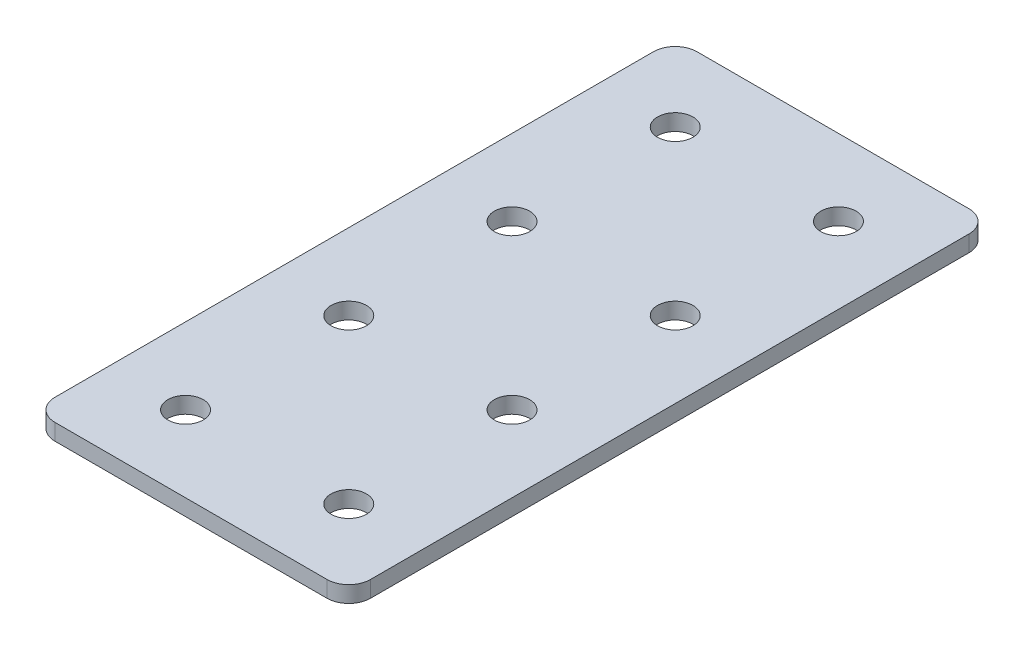
ISO-10303-21;
HEADER;
FILE_DESCRIPTION(('STEP AP214'),'2;1');
FILE_NAME('part.step','',(''),(''),'','','');
FILE_SCHEMA(('AUTOMOTIVE_DESIGN { 1 0 10303 214 1 1 1 1 }'));
ENDSEC;
DATA;
#1=APPLICATION_CONTEXT('core data for automotive mechanical design processes');
#2=APPLICATION_PROTOCOL_DEFINITION('international standard','automotive_design',2000,#1);
#3=PRODUCT_CONTEXT('',#1,'mechanical');
#4=PRODUCT('Part','Part','',(#3));
#5=PRODUCT_RELATED_PRODUCT_CATEGORY('part','',(#4));
#6=PRODUCT_DEFINITION_FORMATION('','',#4);
#7=PRODUCT_DEFINITION_CONTEXT('part definition',#1,'design');
#8=PRODUCT_DEFINITION('design','',#6,#7);
#9=PRODUCT_DEFINITION_SHAPE('','',#8);
#10=(LENGTH_UNIT() NAMED_UNIT(*) SI_UNIT(.MILLI.,.METRE.));
#11=(NAMED_UNIT(*) PLANE_ANGLE_UNIT() SI_UNIT($,.RADIAN.));
#12=(NAMED_UNIT(*) SI_UNIT($,.STERADIAN.) SOLID_ANGLE_UNIT());
#13=UNCERTAINTY_MEASURE_WITH_UNIT(LENGTH_MEASURE(1.E-05),#10,'distance_accuracy_value','');
#14=(GEOMETRIC_REPRESENTATION_CONTEXT(3) GLOBAL_UNCERTAINTY_ASSIGNED_CONTEXT((#13)) GLOBAL_UNIT_ASSIGNED_CONTEXT((#10,
#11,#12)) REPRESENTATION_CONTEXT('',''));
#15=CARTESIAN_POINT('',(0.,0.,0.));
#16=DIRECTION('',(0.,0.,1.));
#17=DIRECTION('',(1.,0.,0.));
#18=AXIS2_PLACEMENT_3D('',#15,#16,#17);
#19=CARTESIAN_POINT('',(-0.94100235452288,1.30807034319605,-23.6167335219397));
#20=DIRECTION('',(0.,-1.,0.));
#21=DIRECTION('',(0.,0.,-1.));
#22=AXIS2_PLACEMENT_3D('',#19,#20,#21);
#23=PLANE('',#22);
#24=CARTESIAN_POINT('',(6.55899764547713,1.30807034319605,21.3832664780603));
#25=DIRECTION('',(0.,1.,0.));
#26=DIRECTION('',(0.,0.,1.));
#27=AXIS2_PLACEMENT_3D('',#24,#25,#26);
#28=CIRCLE('',#27,1.625);
#29=CARTESIAN_POINT('',(6.55899764547713,1.30807034319605,23.0082664780603));
#30=VERTEX_POINT('',#29);
#31=EDGE_CURVE('E189',#30,#30,#28,.T.);
#32=ORIENTED_EDGE('',*,*,#31,.T.);
#33=EDGE_LOOP('',(#32));
#34=FACE_BOUND('',#33,.T.);
#35=CARTESIAN_POINT('',(-8.4410023545229,1.30807034319605,21.3832664780603));
#36=DIRECTION('',(0.,1.,0.));
#37=DIRECTION('',(0.,0.,1.));
#38=AXIS2_PLACEMENT_3D('',#35,#36,#37);
#39=CIRCLE('',#38,1.625);
#40=CARTESIAN_POINT('',(-8.4410023545229,1.30807034319605,23.0082664780603));
#41=VERTEX_POINT('',#40);
#42=EDGE_CURVE('E183',#41,#41,#39,.T.);
#43=ORIENTED_EDGE('',*,*,#42,.T.);
#44=EDGE_LOOP('',(#43));
#45=FACE_BOUND('',#44,.T.);
#46=CARTESIAN_POINT('',(6.55899764547713,1.30807034319605,6.38326647806029));
#47=DIRECTION('',(0.,1.,0.));
#48=DIRECTION('',(0.,0.,1.));
#49=AXIS2_PLACEMENT_3D('',#46,#47,#48);
#50=CIRCLE('',#49,1.625);
#51=CARTESIAN_POINT('',(6.55899764547713,1.30807034319605,8.0082664780603));
#52=VERTEX_POINT('',#51);
#53=EDGE_CURVE('E177',#52,#52,#50,.T.);
#54=ORIENTED_EDGE('',*,*,#53,.T.);
#55=EDGE_LOOP('',(#54));
#56=FACE_BOUND('',#55,.T.);
#57=CARTESIAN_POINT('',(-8.44100235452291,1.30807034319605,6.38326647806029));
#58=DIRECTION('',(0.,1.,0.));
#59=DIRECTION('',(0.,0.,1.));
#60=AXIS2_PLACEMENT_3D('',#57,#58,#59);
#61=CIRCLE('',#60,1.625);
#62=CARTESIAN_POINT('',(-8.44100235452291,1.30807034319605,8.00826647806029));
#63=VERTEX_POINT('',#62);
#64=EDGE_CURVE('E171',#63,#63,#61,.T.);
#65=ORIENTED_EDGE('',*,*,#64,.T.);
#66=EDGE_LOOP('',(#65));
#67=FACE_BOUND('',#66,.T.);
#68=CARTESIAN_POINT('',(6.55899764547713,1.30807034319605,-8.61673352193971));
#69=DIRECTION('',(0.,1.,0.));
#70=DIRECTION('',(0.,0.,1.));
#71=AXIS2_PLACEMENT_3D('',#68,#69,#70);
#72=CIRCLE('',#71,1.625);
#73=CARTESIAN_POINT('',(6.55899764547713,1.30807034319605,-6.99173352193971));
#74=VERTEX_POINT('',#73);
#75=EDGE_CURVE('E165',#74,#74,#72,.T.);
#76=ORIENTED_EDGE('',*,*,#75,.T.);
#77=EDGE_LOOP('',(#76));
#78=FACE_BOUND('',#77,.T.);
#79=CARTESIAN_POINT('',(-8.44100235452291,1.30807034319605,-8.61673352193971));
#80=DIRECTION('',(0.,1.,0.));
#81=DIRECTION('',(0.,0.,1.));
#82=AXIS2_PLACEMENT_3D('',#79,#80,#81);
#83=CIRCLE('',#82,1.625);
#84=CARTESIAN_POINT('',(-8.44100235452291,1.30807034319605,-6.99173352193971));
#85=VERTEX_POINT('',#84);
#86=EDGE_CURVE('E159',#85,#85,#83,.T.);
#87=ORIENTED_EDGE('',*,*,#86,.T.);
#88=EDGE_LOOP('',(#87));
#89=FACE_BOUND('',#88,.T.);
#90=CARTESIAN_POINT('',(6.55899764547713,1.30807034319605,-23.6167335219397));
#91=DIRECTION('',(0.,1.,0.));
#92=DIRECTION('',(0.,0.,1.));
#93=AXIS2_PLACEMENT_3D('',#90,#91,#92);
#94=CIRCLE('',#93,1.625);
#95=CARTESIAN_POINT('',(6.55899764547713,1.30807034319605,-21.9917335219397));
#96=VERTEX_POINT('',#95);
#97=EDGE_CURVE('E154',#96,#96,#94,.T.);
#98=ORIENTED_EDGE('',*,*,#97,.T.);
#99=EDGE_LOOP('',(#98));
#100=FACE_BOUND('',#99,.T.);
#101=CARTESIAN_POINT('',(-8.44100235452291,1.30807034319605,-23.6167335219397));
#102=DIRECTION('',(0.,1.,0.));
#103=DIRECTION('',(0.,0.,1.));
#104=AXIS2_PLACEMENT_3D('',#101,#102,#103);
#105=CIRCLE('',#104,1.625);
#106=CARTESIAN_POINT('',(-8.44100235452291,1.30807034319605,-21.9917335219397));
#107=VERTEX_POINT('',#106);
#108=EDGE_CURVE('E147',#107,#107,#105,.T.);
#109=ORIENTED_EDGE('',*,*,#108,.T.);
#110=EDGE_LOOP('',(#109));
#111=FACE_BOUND('',#110,.T.);
#112=DIRECTION('',(0.,0.,-1.));
#113=VECTOR('',#112,1.);
#114=CARTESIAN_POINT('',(13.5589976454772,1.30807034319605,28.3832664780603));
#115=LINE('',#114,#113);
#116=CARTESIAN_POINT('',(13.5589976454772,1.30807034319605,26.3832664780602));
#117=VERTEX_POINT('',#116);
#118=CARTESIAN_POINT('',(13.5589976454772,1.30807034319605,-28.6167335219397));
#119=VERTEX_POINT('',#118);
#120=EDGE_CURVE('E106',#117,#119,#115,.T.);
#121=ORIENTED_EDGE('',*,*,#120,.F.);
#122=CARTESIAN_POINT('',(11.5589976454772,1.30807034319605,26.3832664780602));
#123=DIRECTION('',(0.,-1.,0.));
#124=DIRECTION('',(0.,0.,-1.));
#125=AXIS2_PLACEMENT_3D('',#122,#123,#124);
#126=CIRCLE('',#125,2.);
#127=CARTESIAN_POINT('',(11.5589976454772,1.30807034319605,28.3832664780603));
#128=VERTEX_POINT('',#127);
#129=EDGE_CURVE('E128',#117,#128,#126,.T.);
#130=ORIENTED_EDGE('',*,*,#129,.T.);
#131=DIRECTION('',(1.,0.,0.));
#132=VECTOR('',#131,1.);
#133=CARTESIAN_POINT('',(-15.441002354523,1.30807034319605,28.3832664780603));
#134=LINE('',#133,#132);
#135=CARTESIAN_POINT('',(-13.441002354523,1.30807034319605,28.3832664780603));
#136=VERTEX_POINT('',#135);
#137=EDGE_CURVE('E110',#136,#128,#134,.T.);
#138=ORIENTED_EDGE('',*,*,#137,.F.);
#139=CARTESIAN_POINT('',(-13.441002354523,1.30807034319605,26.3832664780602));
#140=DIRECTION('',(0.,-1.,0.));
#141=DIRECTION('',(0.,0.,-1.));
#142=AXIS2_PLACEMENT_3D('',#139,#140,#141);
#143=CIRCLE('',#142,2.);
#144=CARTESIAN_POINT('',(-15.441002354523,1.30807034319605,26.3832664780602));
#145=VERTEX_POINT('',#144);
#146=EDGE_CURVE('E105',#136,#145,#143,.T.);
#147=ORIENTED_EDGE('',*,*,#146,.T.);
#148=DIRECTION('',(0.,0.,1.));
#149=VECTOR('',#148,1.);
#150=CARTESIAN_POINT('',(-15.441002354523,1.30807034319605,-30.6167335219397));
#151=LINE('',#150,#149);
#152=CARTESIAN_POINT('',(-15.441002354523,1.30807034319605,-28.6167335219397));
#153=VERTEX_POINT('',#152);
#154=EDGE_CURVE('E137',#153,#145,#151,.T.);
#155=ORIENTED_EDGE('',*,*,#154,.F.);
#156=CARTESIAN_POINT('',(-13.441002354523,1.30807034319605,-28.6167335219397));
#157=DIRECTION('',(0.,-1.,0.));
#158=DIRECTION('',(0.,0.,-1.));
#159=AXIS2_PLACEMENT_3D('',#156,#157,#158);
#160=CIRCLE('',#159,2.);
#161=CARTESIAN_POINT('',(-13.441002354523,1.30807034319605,-30.6167335219397));
#162=VERTEX_POINT('',#161);
#163=EDGE_CURVE('E31',#153,#162,#160,.T.);
#164=ORIENTED_EDGE('',*,*,#163,.T.);
#165=DIRECTION('',(-1.,0.,0.));
#166=VECTOR('',#165,1.);
#167=CARTESIAN_POINT('',(13.5589976454772,1.30807034319605,-30.6167335219398));
#168=LINE('',#167,#166);
#169=CARTESIAN_POINT('',(11.5589976454772,1.30807034319605,-30.6167335219398));
#170=VERTEX_POINT('',#169);
#171=EDGE_CURVE('E138',#170,#162,#168,.T.);
#172=ORIENTED_EDGE('',*,*,#171,.F.);
#173=CARTESIAN_POINT('',(11.5589976454772,1.30807034319605,-28.6167335219398));
#174=DIRECTION('',(0.,-1.,0.));
#175=DIRECTION('',(0.,0.,-1.));
#176=AXIS2_PLACEMENT_3D('',#173,#174,#175);
#177=CIRCLE('',#176,2.);
#178=EDGE_CURVE('E126',#170,#119,#177,.T.);
#179=ORIENTED_EDGE('',*,*,#178,.T.);
#180=EDGE_LOOP('',(#121,#130,#138,#147,#155,#164,#172,#179));
#181=FACE_BOUND('',#180,.T.);
#182=ADVANCED_FACE('F16',(#34,#45,#56,#67,#78,#89,#100,#111,#181),#23,.T.);
#183=CARTESIAN_POINT('',(13.5589976454772,1.30807034319605,-30.6167335219398));
#184=DIRECTION('',(0.,0.,-1.));
#185=DIRECTION('',(-1.,0.,0.));
#186=AXIS2_PLACEMENT_3D('',#183,#184,#185);
#187=PLANE('',#186);
#188=DIRECTION('',(-1.,0.,0.));
#189=VECTOR('',#188,1.);
#190=CARTESIAN_POINT('',(13.5589976454772,2.80807034319605,-30.6167335219398));
#191=LINE('',#190,#189);
#192=CARTESIAN_POINT('',(11.5589976454772,2.80807034319605,-30.6167335219398));
#193=VERTEX_POINT('',#192);
#194=CARTESIAN_POINT('',(-13.441002354523,2.80807034319605,-30.6167335219397));
#195=VERTEX_POINT('',#194);
#196=EDGE_CURVE('E144',#193,#195,#191,.T.);
#197=ORIENTED_EDGE('',*,*,#196,.F.);
#198=DIRECTION('',(0.,1.,0.));
#199=VECTOR('',#198,1.);
#200=CARTESIAN_POINT('',(11.5589976454772,1.30807034319605,-30.6167335219398));
#201=LINE('',#200,#199);
#202=EDGE_CURVE('E38',#193,#170,#201,.F.);
#203=ORIENTED_EDGE('',*,*,#202,.T.);
#204=ORIENTED_EDGE('',*,*,#171,.T.);
#205=DIRECTION('',(0.,1.,0.));
#206=VECTOR('',#205,1.);
#207=CARTESIAN_POINT('',(-13.441002354523,1.30807034319605,-30.6167335219397));
#208=LINE('',#207,#206);
#209=EDGE_CURVE('E130',#162,#195,#208,.T.);
#210=ORIENTED_EDGE('',*,*,#209,.T.);
#211=EDGE_LOOP('',(#197,#203,#204,#210));
#212=FACE_BOUND('',#211,.T.);
#213=ADVANCED_FACE('F239',(#212),#187,.T.);
#214=CARTESIAN_POINT('',(13.5589976454772,1.30807034319605,28.3832664780603));
#215=DIRECTION('',(1.,0.,0.));
#216=DIRECTION('',(0.,0.,-1.));
#217=AXIS2_PLACEMENT_3D('',#214,#215,#216);
#218=PLANE('',#217);
#219=DIRECTION('',(0.,0.,-1.));
#220=VECTOR('',#219,1.);
#221=CARTESIAN_POINT('',(13.5589976454772,2.80807034319605,28.3832664780603));
#222=LINE('',#221,#220);
#223=CARTESIAN_POINT('',(13.5589976454772,2.80807034319605,26.3832664780602));
#224=VERTEX_POINT('',#223);
#225=CARTESIAN_POINT('',(13.5589976454772,2.80807034319605,-28.6167335219397));
#226=VERTEX_POINT('',#225);
#227=EDGE_CURVE('E102',#224,#226,#222,.T.);
#228=ORIENTED_EDGE('',*,*,#227,.F.);
#229=DIRECTION('',(0.,1.,0.));
#230=VECTOR('',#229,1.);
#231=CARTESIAN_POINT('',(13.5589976454772,1.30807034319605,26.3832664780602));
#232=LINE('',#231,#230);
#233=EDGE_CURVE('E122',#224,#117,#232,.F.);
#234=ORIENTED_EDGE('',*,*,#233,.T.);
#235=ORIENTED_EDGE('',*,*,#120,.T.);
#236=DIRECTION('',(0.,1.,0.));
#237=VECTOR('',#236,1.);
#238=CARTESIAN_POINT('',(13.5589976454772,1.30807034319605,-28.6167335219398));
#239=LINE('',#238,#237);
#240=EDGE_CURVE('E119',#119,#226,#239,.T.);
#241=ORIENTED_EDGE('',*,*,#240,.T.);
#242=EDGE_LOOP('',(#228,#234,#235,#241));
#243=FACE_BOUND('',#242,.T.);
#244=ADVANCED_FACE('F244',(#243),#218,.T.);
#245=CARTESIAN_POINT('',(-15.441002354523,1.30807034319605,28.3832664780603));
#246=DIRECTION('',(0.,0.,1.));
#247=DIRECTION('',(1.,0.,0.));
#248=AXIS2_PLACEMENT_3D('',#245,#246,#247);
#249=PLANE('',#248);
#250=ORIENTED_EDGE('',*,*,#137,.T.);
#251=DIRECTION('',(0.,1.,0.));
#252=VECTOR('',#251,1.);
#253=CARTESIAN_POINT('',(11.5589976454772,1.30807034319605,28.3832664780603));
#254=LINE('',#253,#252);
#255=CARTESIAN_POINT('',(11.5589976454772,2.80807034319605,28.3832664780603));
#256=VERTEX_POINT('',#255);
#257=EDGE_CURVE('E93',#128,#256,#254,.T.);
#258=ORIENTED_EDGE('',*,*,#257,.T.);
#259=DIRECTION('',(1.,0.,0.));
#260=VECTOR('',#259,1.);
#261=CARTESIAN_POINT('',(-15.441002354523,2.80807034319605,28.3832664780603));
#262=LINE('',#261,#260);
#263=CARTESIAN_POINT('',(-13.441002354523,2.80807034319605,28.3832664780603));
#264=VERTEX_POINT('',#263);
#265=EDGE_CURVE('E85',#264,#256,#262,.T.);
#266=ORIENTED_EDGE('',*,*,#265,.F.);
#267=DIRECTION('',(0.,1.,0.));
#268=VECTOR('',#267,1.);
#269=CARTESIAN_POINT('',(-13.441002354523,1.30807034319605,28.3832664780603));
#270=LINE('',#269,#268);
#271=EDGE_CURVE('E99',#264,#136,#270,.F.);
#272=ORIENTED_EDGE('',*,*,#271,.T.);
#273=EDGE_LOOP('',(#250,#258,#266,#272));
#274=FACE_BOUND('',#273,.T.);
#275=ADVANCED_FACE('F98',(#274),#249,.T.);
#276=CARTESIAN_POINT('',(-15.441002354523,1.30807034319605,-30.6167335219397));
#277=DIRECTION('',(-1.,0.,0.));
#278=DIRECTION('',(0.,0.,1.));
#279=AXIS2_PLACEMENT_3D('',#276,#277,#278);
#280=PLANE('',#279);
#281=DIRECTION('',(0.,0.,1.));
#282=VECTOR('',#281,1.);
#283=CARTESIAN_POINT('',(-15.441002354523,2.80807034319605,-30.6167335219397));
#284=LINE('',#283,#282);
#285=CARTESIAN_POINT('',(-15.441002354523,2.80807034319605,-28.6167335219397));
#286=VERTEX_POINT('',#285);
#287=CARTESIAN_POINT('',(-15.441002354523,2.80807034319605,26.3832664780602));
#288=VERTEX_POINT('',#287);
#289=EDGE_CURVE('E87',#286,#288,#284,.T.);
#290=ORIENTED_EDGE('',*,*,#289,.F.);
#291=DIRECTION('',(0.,1.,0.));
#292=VECTOR('',#291,1.);
#293=CARTESIAN_POINT('',(-15.441002354523,1.30807034319605,-28.6167335219397));
#294=LINE('',#293,#292);
#295=EDGE_CURVE('E10',#286,#153,#294,.F.);
#296=ORIENTED_EDGE('',*,*,#295,.T.);
#297=ORIENTED_EDGE('',*,*,#154,.T.);
#298=DIRECTION('',(0.,1.,0.));
#299=VECTOR('',#298,1.);
#300=CARTESIAN_POINT('',(-15.441002354523,1.30807034319605,26.3832664780602));
#301=LINE('',#300,#299);
#302=EDGE_CURVE('E24',#145,#288,#301,.T.);
#303=ORIENTED_EDGE('',*,*,#302,.T.);
#304=EDGE_LOOP('',(#290,#296,#297,#303));
#305=FACE_BOUND('',#304,.T.);
#306=ADVANCED_FACE('F135',(#305),#280,.T.);
#307=CARTESIAN_POINT('',(-0.94100235452288,2.80807034319605,-23.6167335219397));
#308=DIRECTION('',(0.,-1.,0.));
#309=DIRECTION('',(0.,0.,-1.));
#310=AXIS2_PLACEMENT_3D('',#307,#308,#309);
#311=PLANE('',#310);
#312=CARTESIAN_POINT('',(6.55899764547713,2.80807034319605,21.3832664780603));
#313=DIRECTION('',(0.,1.,0.));
#314=DIRECTION('',(0.,0.,1.));
#315=AXIS2_PLACEMENT_3D('',#312,#313,#314);
#316=CIRCLE('',#315,1.625);
#317=CARTESIAN_POINT('',(6.55899764547713,2.80807034319605,23.0082664780603));
#318=VERTEX_POINT('',#317);
#319=EDGE_CURVE('E192',#318,#318,#316,.T.);
#320=ORIENTED_EDGE('',*,*,#319,.F.);
#321=EDGE_LOOP('',(#320));
#322=FACE_BOUND('',#321,.T.);
#323=CARTESIAN_POINT('',(-8.4410023545229,2.80807034319605,21.3832664780603));
#324=DIRECTION('',(0.,1.,0.));
#325=DIRECTION('',(0.,0.,1.));
#326=AXIS2_PLACEMENT_3D('',#323,#324,#325);
#327=CIRCLE('',#326,1.625);
#328=CARTESIAN_POINT('',(-8.4410023545229,2.80807034319605,23.0082664780603));
#329=VERTEX_POINT('',#328);
#330=EDGE_CURVE('E186',#329,#329,#327,.T.);
#331=ORIENTED_EDGE('',*,*,#330,.F.);
#332=EDGE_LOOP('',(#331));
#333=FACE_BOUND('',#332,.T.);
#334=CARTESIAN_POINT('',(6.55899764547713,2.80807034319605,6.38326647806029));
#335=DIRECTION('',(0.,1.,0.));
#336=DIRECTION('',(0.,0.,1.));
#337=AXIS2_PLACEMENT_3D('',#334,#335,#336);
#338=CIRCLE('',#337,1.625);
#339=CARTESIAN_POINT('',(6.55899764547713,2.80807034319605,8.0082664780603));
#340=VERTEX_POINT('',#339);
#341=EDGE_CURVE('E180',#340,#340,#338,.T.);
#342=ORIENTED_EDGE('',*,*,#341,.F.);
#343=EDGE_LOOP('',(#342));
#344=FACE_BOUND('',#343,.T.);
#345=CARTESIAN_POINT('',(-8.44100235452291,2.80807034319605,6.38326647806029));
#346=DIRECTION('',(0.,1.,0.));
#347=DIRECTION('',(0.,0.,1.));
#348=AXIS2_PLACEMENT_3D('',#345,#346,#347);
#349=CIRCLE('',#348,1.625);
#350=CARTESIAN_POINT('',(-8.44100235452291,2.80807034319605,8.00826647806029));
#351=VERTEX_POINT('',#350);
#352=EDGE_CURVE('E174',#351,#351,#349,.T.);
#353=ORIENTED_EDGE('',*,*,#352,.F.);
#354=EDGE_LOOP('',(#353));
#355=FACE_BOUND('',#354,.T.);
#356=CARTESIAN_POINT('',(6.55899764547713,2.80807034319605,-8.61673352193971));
#357=DIRECTION('',(0.,1.,0.));
#358=DIRECTION('',(0.,0.,1.));
#359=AXIS2_PLACEMENT_3D('',#356,#357,#358);
#360=CIRCLE('',#359,1.625);
#361=CARTESIAN_POINT('',(6.55899764547713,2.80807034319605,-6.99173352193971));
#362=VERTEX_POINT('',#361);
#363=EDGE_CURVE('E168',#362,#362,#360,.T.);
#364=ORIENTED_EDGE('',*,*,#363,.F.);
#365=EDGE_LOOP('',(#364));
#366=FACE_BOUND('',#365,.T.);
#367=CARTESIAN_POINT('',(-8.44100235452291,2.80807034319605,-8.61673352193971));
#368=DIRECTION('',(0.,1.,0.));
#369=DIRECTION('',(0.,0.,1.));
#370=AXIS2_PLACEMENT_3D('',#367,#368,#369);
#371=CIRCLE('',#370,1.625);
#372=CARTESIAN_POINT('',(-8.44100235452291,2.80807034319605,-6.99173352193971));
#373=VERTEX_POINT('',#372);
#374=EDGE_CURVE('E162',#373,#373,#371,.T.);
#375=ORIENTED_EDGE('',*,*,#374,.F.);
#376=EDGE_LOOP('',(#375));
#377=FACE_BOUND('',#376,.T.);
#378=CARTESIAN_POINT('',(6.55899764547713,2.80807034319605,-23.6167335219397));
#379=DIRECTION('',(0.,1.,0.));
#380=DIRECTION('',(0.,0.,1.));
#381=AXIS2_PLACEMENT_3D('',#378,#379,#380);
#382=CIRCLE('',#381,1.625);
#383=CARTESIAN_POINT('',(6.55899764547713,2.80807034319605,-21.9917335219397));
#384=VERTEX_POINT('',#383);
#385=EDGE_CURVE('E156',#384,#384,#382,.T.);
#386=ORIENTED_EDGE('',*,*,#385,.F.);
#387=EDGE_LOOP('',(#386));
#388=FACE_BOUND('',#387,.T.);
#389=CARTESIAN_POINT('',(-8.44100235452291,2.80807034319605,-23.6167335219397));
#390=DIRECTION('',(0.,1.,0.));
#391=DIRECTION('',(0.,0.,1.));
#392=AXIS2_PLACEMENT_3D('',#389,#390,#391);
#393=CIRCLE('',#392,1.625);
#394=CARTESIAN_POINT('',(-8.44100235452291,2.80807034319605,-21.9917335219397));
#395=VERTEX_POINT('',#394);
#396=EDGE_CURVE('E149',#395,#395,#393,.T.);
#397=ORIENTED_EDGE('',*,*,#396,.F.);
#398=EDGE_LOOP('',(#397));
#399=FACE_BOUND('',#398,.T.);
#400=ORIENTED_EDGE('',*,*,#265,.T.);
#401=CARTESIAN_POINT('',(11.5589976454772,2.80807034319605,26.3832664780602));
#402=DIRECTION('',(0.,-1.,0.));
#403=DIRECTION('',(0.,0.,-1.));
#404=AXIS2_PLACEMENT_3D('',#401,#402,#403);
#405=CIRCLE('',#404,2.);
#406=EDGE_CURVE('E117',#256,#224,#405,.F.);
#407=ORIENTED_EDGE('',*,*,#406,.T.);
#408=ORIENTED_EDGE('',*,*,#227,.T.);
#409=CARTESIAN_POINT('',(11.5589976454772,2.80807034319605,-28.6167335219398));
#410=DIRECTION('',(0.,-1.,0.));
#411=DIRECTION('',(0.,0.,-1.));
#412=AXIS2_PLACEMENT_3D('',#409,#410,#411);
#413=CIRCLE('',#412,2.);
#414=EDGE_CURVE('E115',#226,#193,#413,.F.);
#415=ORIENTED_EDGE('',*,*,#414,.T.);
#416=ORIENTED_EDGE('',*,*,#196,.T.);
#417=CARTESIAN_POINT('',(-13.441002354523,2.80807034319605,-28.6167335219397));
#418=DIRECTION('',(0.,-1.,0.));
#419=DIRECTION('',(0.,0.,-1.));
#420=AXIS2_PLACEMENT_3D('',#417,#418,#419);
#421=CIRCLE('',#420,2.);
#422=EDGE_CURVE('E92',#195,#286,#421,.F.);
#423=ORIENTED_EDGE('',*,*,#422,.T.);
#424=ORIENTED_EDGE('',*,*,#289,.T.);
#425=CARTESIAN_POINT('',(-13.441002354523,2.80807034319605,26.3832664780602));
#426=DIRECTION('',(0.,-1.,0.));
#427=DIRECTION('',(0.,0.,-1.));
#428=AXIS2_PLACEMENT_3D('',#425,#426,#427);
#429=CIRCLE('',#428,2.);
#430=EDGE_CURVE('E82',#288,#264,#429,.F.);
#431=ORIENTED_EDGE('',*,*,#430,.T.);
#432=EDGE_LOOP('',(#400,#407,#408,#415,#416,#423,#424,#431));
#433=FACE_BOUND('',#432,.T.);
#434=ADVANCED_FACE('F84',(#322,#333,#344,#355,#366,#377,#388,#399,#433),#311,.F.);
#435=CARTESIAN_POINT('',(-8.44100235452291,1.30807034319605,-23.6167335219397));
#436=DIRECTION('',(0.,1.,0.));
#437=DIRECTION('',(0.,0.,1.));
#438=AXIS2_PLACEMENT_3D('',#435,#436,#437);
#439=CYLINDRICAL_SURFACE('',#438,1.625);
#440=ORIENTED_EDGE('',*,*,#108,.F.);
#441=EDGE_LOOP('',(#440));
#442=FACE_BOUND('',#441,.T.);
#443=ORIENTED_EDGE('',*,*,#396,.T.);
#444=EDGE_LOOP('',(#443));
#445=FACE_BOUND('',#444,.T.);
#446=ADVANCED_FACE('F210',(#442,#445),#439,.F.);
#447=CARTESIAN_POINT('',(6.55899764547713,1.30807034319605,-23.6167335219397));
#448=DIRECTION('',(0.,1.,0.));
#449=DIRECTION('',(0.,0.,1.));
#450=AXIS2_PLACEMENT_3D('',#447,#448,#449);
#451=CYLINDRICAL_SURFACE('',#450,1.625);
#452=ORIENTED_EDGE('',*,*,#97,.F.);
#453=EDGE_LOOP('',(#452));
#454=FACE_BOUND('',#453,.T.);
#455=ORIENTED_EDGE('',*,*,#385,.T.);
#456=EDGE_LOOP('',(#455));
#457=FACE_BOUND('',#456,.T.);
#458=ADVANCED_FACE('F227',(#454,#457),#451,.F.);
#459=CARTESIAN_POINT('',(-8.44100235452291,1.30807034319605,-8.61673352193971));
#460=DIRECTION('',(0.,1.,0.));
#461=DIRECTION('',(0.,0.,1.));
#462=AXIS2_PLACEMENT_3D('',#459,#460,#461);
#463=CYLINDRICAL_SURFACE('',#462,1.625);
#464=ORIENTED_EDGE('',*,*,#86,.F.);
#465=EDGE_LOOP('',(#464));
#466=FACE_BOUND('',#465,.T.);
#467=ORIENTED_EDGE('',*,*,#374,.T.);
#468=EDGE_LOOP('',(#467));
#469=FACE_BOUND('',#468,.T.);
#470=ADVANCED_FACE('F234',(#466,#469),#463,.F.);
#471=CARTESIAN_POINT('',(6.55899764547713,1.30807034319605,-8.61673352193971));
#472=DIRECTION('',(0.,1.,0.));
#473=DIRECTION('',(0.,0.,1.));
#474=AXIS2_PLACEMENT_3D('',#471,#472,#473);
#475=CYLINDRICAL_SURFACE('',#474,1.625);
#476=ORIENTED_EDGE('',*,*,#75,.F.);
#477=EDGE_LOOP('',(#476));
#478=FACE_BOUND('',#477,.T.);
#479=ORIENTED_EDGE('',*,*,#363,.T.);
#480=EDGE_LOOP('',(#479));
#481=FACE_BOUND('',#480,.T.);
#482=ADVANCED_FACE('F307',(#478,#481),#475,.F.);
#483=CARTESIAN_POINT('',(-8.44100235452291,1.30807034319605,6.38326647806029));
#484=DIRECTION('',(0.,1.,0.));
#485=DIRECTION('',(0.,0.,1.));
#486=AXIS2_PLACEMENT_3D('',#483,#484,#485);
#487=CYLINDRICAL_SURFACE('',#486,1.625);
#488=ORIENTED_EDGE('',*,*,#64,.F.);
#489=EDGE_LOOP('',(#488));
#490=FACE_BOUND('',#489,.T.);
#491=ORIENTED_EDGE('',*,*,#352,.T.);
#492=EDGE_LOOP('',(#491));
#493=FACE_BOUND('',#492,.T.);
#494=ADVANCED_FACE('F317',(#490,#493),#487,.F.);
#495=CARTESIAN_POINT('',(6.55899764547713,1.30807034319605,6.38326647806029));
#496=DIRECTION('',(0.,1.,0.));
#497=DIRECTION('',(0.,0.,1.));
#498=AXIS2_PLACEMENT_3D('',#495,#496,#497);
#499=CYLINDRICAL_SURFACE('',#498,1.625);
#500=ORIENTED_EDGE('',*,*,#53,.F.);
#501=EDGE_LOOP('',(#500));
#502=FACE_BOUND('',#501,.T.);
#503=ORIENTED_EDGE('',*,*,#341,.T.);
#504=EDGE_LOOP('',(#503));
#505=FACE_BOUND('',#504,.T.);
#506=ADVANCED_FACE('F327',(#502,#505),#499,.F.);
#507=CARTESIAN_POINT('',(-8.4410023545229,1.30807034319605,21.3832664780603));
#508=DIRECTION('',(0.,1.,0.));
#509=DIRECTION('',(0.,0.,1.));
#510=AXIS2_PLACEMENT_3D('',#507,#508,#509);
#511=CYLINDRICAL_SURFACE('',#510,1.625);
#512=ORIENTED_EDGE('',*,*,#42,.F.);
#513=EDGE_LOOP('',(#512));
#514=FACE_BOUND('',#513,.T.);
#515=ORIENTED_EDGE('',*,*,#330,.T.);
#516=EDGE_LOOP('',(#515));
#517=FACE_BOUND('',#516,.T.);
#518=ADVANCED_FACE('F204',(#514,#517),#511,.F.);
#519=CARTESIAN_POINT('',(6.55899764547713,1.30807034319605,21.3832664780603));
#520=DIRECTION('',(0.,1.,0.));
#521=DIRECTION('',(0.,0.,1.));
#522=AXIS2_PLACEMENT_3D('',#519,#520,#521);
#523=CYLINDRICAL_SURFACE('',#522,1.625);
#524=ORIENTED_EDGE('',*,*,#31,.F.);
#525=EDGE_LOOP('',(#524));
#526=FACE_BOUND('',#525,.T.);
#527=ORIENTED_EDGE('',*,*,#319,.T.);
#528=EDGE_LOOP('',(#527));
#529=FACE_BOUND('',#528,.T.);
#530=ADVANCED_FACE('F200',(#526,#529),#523,.F.);
#531=CARTESIAN_POINT('',(11.5589976454772,1.30807034319605,26.3832664780602));
#532=DIRECTION('',(0.,1.,0.));
#533=DIRECTION('',(0.,0.,1.));
#534=AXIS2_PLACEMENT_3D('',#531,#532,#533);
#535=CYLINDRICAL_SURFACE('',#534,2.);
#536=ORIENTED_EDGE('',*,*,#129,.F.);
#537=ORIENTED_EDGE('',*,*,#233,.F.);
#538=ORIENTED_EDGE('',*,*,#406,.F.);
#539=ORIENTED_EDGE('',*,*,#257,.F.);
#540=EDGE_LOOP('',(#536,#537,#538,#539));
#541=FACE_BOUND('',#540,.T.);
#542=ADVANCED_FACE('F203',(#541),#535,.T.);
#543=CARTESIAN_POINT('',(11.5589976454772,1.30807034319605,-28.6167335219398));
#544=DIRECTION('',(0.,1.,0.));
#545=DIRECTION('',(0.,0.,1.));
#546=AXIS2_PLACEMENT_3D('',#543,#544,#545);
#547=CYLINDRICAL_SURFACE('',#546,2.);
#548=ORIENTED_EDGE('',*,*,#178,.F.);
#549=ORIENTED_EDGE('',*,*,#202,.F.);
#550=ORIENTED_EDGE('',*,*,#414,.F.);
#551=ORIENTED_EDGE('',*,*,#240,.F.);
#552=EDGE_LOOP('',(#548,#549,#550,#551));
#553=FACE_BOUND('',#552,.T.);
#554=ADVANCED_FACE('F249',(#553),#547,.T.);
#555=CARTESIAN_POINT('',(-13.441002354523,1.30807034319605,-28.6167335219397));
#556=DIRECTION('',(0.,1.,0.));
#557=DIRECTION('',(0.,0.,1.));
#558=AXIS2_PLACEMENT_3D('',#555,#556,#557);
#559=CYLINDRICAL_SURFACE('',#558,2.);
#560=ORIENTED_EDGE('',*,*,#163,.F.);
#561=ORIENTED_EDGE('',*,*,#295,.F.);
#562=ORIENTED_EDGE('',*,*,#422,.F.);
#563=ORIENTED_EDGE('',*,*,#209,.F.);
#564=EDGE_LOOP('',(#560,#561,#562,#563));
#565=FACE_BOUND('',#564,.T.);
#566=ADVANCED_FACE('F252',(#565),#559,.T.);
#567=CARTESIAN_POINT('',(-13.441002354523,1.30807034319605,26.3832664780602));
#568=DIRECTION('',(0.,1.,0.));
#569=DIRECTION('',(0.,0.,1.));
#570=AXIS2_PLACEMENT_3D('',#567,#568,#569);
#571=CYLINDRICAL_SURFACE('',#570,2.);
#572=ORIENTED_EDGE('',*,*,#146,.F.);
#573=ORIENTED_EDGE('',*,*,#271,.F.);
#574=ORIENTED_EDGE('',*,*,#430,.F.);
#575=ORIENTED_EDGE('',*,*,#302,.F.);
#576=EDGE_LOOP('',(#572,#573,#574,#575));
#577=FACE_BOUND('',#576,.T.);
#578=ADVANCED_FACE('F18',(#577),#571,.T.);
#579=CLOSED_SHELL('',(#182,#213,#244,#275,#306,#434,#446,#458,#470,#482,#494,#506,#518,#530,
#542,#554,#566,#578));
#580=MANIFOLD_SOLID_BREP('B1',#579);
#581=ADVANCED_BREP_SHAPE_REPRESENTATION('',(#18,#580),#14);
#582=SHAPE_DEFINITION_REPRESENTATION(#9,#581);
ENDSEC;
END-ISO-10303-21;
